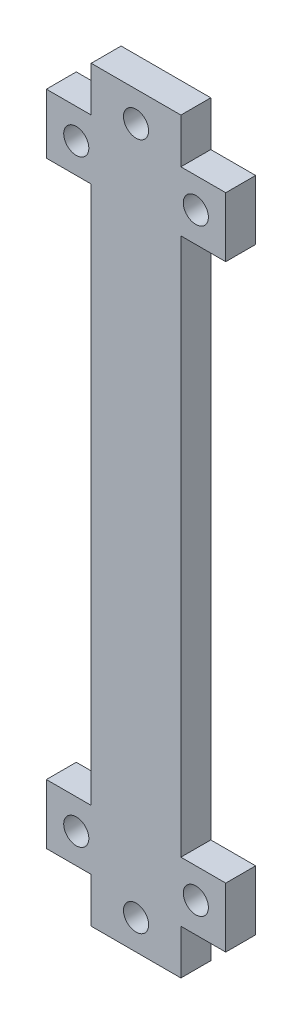
ISO-10303-21;
HEADER;
FILE_DESCRIPTION(('STEP AP214'),'2;1');
FILE_NAME('part.step','',(''),(''),'','','');
FILE_SCHEMA(('AUTOMOTIVE_DESIGN { 1 0 10303 214 1 1 1 1 }'));
ENDSEC;
DATA;
#1=APPLICATION_CONTEXT('core data for automotive mechanical design processes');
#2=APPLICATION_PROTOCOL_DEFINITION('international standard','automotive_design',2000,#1);
#3=PRODUCT_CONTEXT('',#1,'mechanical');
#4=PRODUCT('Part','Part','',(#3));
#5=PRODUCT_RELATED_PRODUCT_CATEGORY('part','',(#4));
#6=PRODUCT_DEFINITION_FORMATION('','',#4);
#7=PRODUCT_DEFINITION_CONTEXT('part definition',#1,'design');
#8=PRODUCT_DEFINITION('design','',#6,#7);
#9=PRODUCT_DEFINITION_SHAPE('','',#8);
#10=(LENGTH_UNIT() NAMED_UNIT(*) SI_UNIT(.MILLI.,.METRE.));
#11=(NAMED_UNIT(*) PLANE_ANGLE_UNIT() SI_UNIT($,.RADIAN.));
#12=(NAMED_UNIT(*) SI_UNIT($,.STERADIAN.) SOLID_ANGLE_UNIT());
#13=UNCERTAINTY_MEASURE_WITH_UNIT(LENGTH_MEASURE(1.E-05),#10,'distance_accuracy_value','');
#14=(GEOMETRIC_REPRESENTATION_CONTEXT(3) GLOBAL_UNCERTAINTY_ASSIGNED_CONTEXT((#13)) GLOBAL_UNIT_ASSIGNED_CONTEXT((#10,
#11,#12)) REPRESENTATION_CONTEXT('',''));
#15=CARTESIAN_POINT('',(0.,0.,0.));
#16=DIRECTION('',(0.,0.,1.));
#17=DIRECTION('',(1.,0.,0.));
#18=AXIS2_PLACEMENT_3D('',#15,#16,#17);
#19=CARTESIAN_POINT('',(0.,0.,5.));
#20=DIRECTION('',(-1.,0.,0.));
#21=DIRECTION('',(0.,0.,1.));
#22=AXIS2_PLACEMENT_3D('',#19,#20,#21);
#23=PLANE('',#22);
#24=DIRECTION('',(0.,1.,0.));
#25=VECTOR('',#24,1.);
#26=CARTESIAN_POINT('',(0.,0.,0.));
#27=LINE('',#26,#25);
#28=CARTESIAN_POINT('',(0.,0.,0.));
#29=VERTEX_POINT('',#28);
#30=CARTESIAN_POINT('',(0.,90.,0.));
#31=VERTEX_POINT('',#30);
#32=EDGE_CURVE('E224',#29,#31,#27,.T.);
#33=ORIENTED_EDGE('',*,*,#32,.F.);
#34=DIRECTION('',(0.,0.,-1.));
#35=VECTOR('',#34,1.);
#36=CARTESIAN_POINT('',(0.,0.,5.));
#37=LINE('',#36,#35);
#38=CARTESIAN_POINT('',(0.,0.,5.));
#39=VERTEX_POINT('',#38);
#40=EDGE_CURVE('E11',#39,#29,#37,.T.);
#41=ORIENTED_EDGE('',*,*,#40,.F.);
#42=DIRECTION('',(0.,1.,0.));
#43=VECTOR('',#42,1.);
#44=CARTESIAN_POINT('',(0.,0.,5.));
#45=LINE('',#44,#43);
#46=CARTESIAN_POINT('',(0.,90.,5.));
#47=VERTEX_POINT('',#46);
#48=EDGE_CURVE('E287',#39,#47,#45,.T.);
#49=ORIENTED_EDGE('',*,*,#48,.T.);
#50=DIRECTION('',(0.,0.,-1.));
#51=VECTOR('',#50,1.);
#52=CARTESIAN_POINT('',(0.,90.,5.));
#53=LINE('',#52,#51);
#54=EDGE_CURVE('E123',#47,#31,#53,.T.);
#55=ORIENTED_EDGE('',*,*,#54,.T.);
#56=EDGE_LOOP('',(#33,#41,#49,#55));
#57=FACE_BOUND('',#56,.T.);
#58=ADVANCED_FACE('F37',(#57),#23,.T.);
#59=CARTESIAN_POINT('',(0.,0.,5.));
#60=DIRECTION('',(0.,1.,0.));
#61=DIRECTION('',(0.,0.,1.));
#62=AXIS2_PLACEMENT_3D('',#59,#60,#61);
#63=PLANE('',#62);
#64=DIRECTION('',(1.,0.,0.));
#65=VECTOR('',#64,1.);
#66=CARTESIAN_POINT('',(0.,0.,0.));
#67=LINE('',#66,#65);
#68=CARTESIAN_POINT('',(-7.5,0.,0.));
#69=VERTEX_POINT('',#68);
#70=EDGE_CURVE('E227',#69,#29,#67,.T.);
#71=ORIENTED_EDGE('',*,*,#70,.F.);
#72=DIRECTION('',(0.,0.,-1.));
#73=VECTOR('',#72,1.);
#74=CARTESIAN_POINT('',(-7.5,0.,5.));
#75=LINE('',#74,#73);
#76=CARTESIAN_POINT('',(-7.5,0.,5.));
#77=VERTEX_POINT('',#76);
#78=EDGE_CURVE('E45',#77,#69,#75,.T.);
#79=ORIENTED_EDGE('',*,*,#78,.F.);
#80=DIRECTION('',(1.,0.,0.));
#81=VECTOR('',#80,1.);
#82=CARTESIAN_POINT('',(0.,0.,5.));
#83=LINE('',#82,#81);
#84=EDGE_CURVE('E339',#77,#39,#83,.T.);
#85=ORIENTED_EDGE('',*,*,#84,.T.);
#86=ORIENTED_EDGE('',*,*,#40,.T.);
#87=EDGE_LOOP('',(#71,#79,#85,#86));
#88=FACE_BOUND('',#87,.T.);
#89=ADVANCED_FACE('F338',(#88),#63,.T.);
#90=CARTESIAN_POINT('',(-7.5,0.,5.));
#91=DIRECTION('',(1.,0.,0.));
#92=DIRECTION('',(0.,0.,-1.));
#93=AXIS2_PLACEMENT_3D('',#90,#91,#92);
#94=PLANE('',#93);
#95=DIRECTION('',(0.,-1.,0.));
#96=VECTOR('',#95,1.);
#97=CARTESIAN_POINT('',(-7.5,0.,0.));
#98=LINE('',#97,#96);
#99=CARTESIAN_POINT('',(-7.5,-10.,0.));
#100=VERTEX_POINT('',#99);
#101=EDGE_CURVE('E230',#69,#100,#98,.T.);
#102=ORIENTED_EDGE('',*,*,#101,.T.);
#103=DIRECTION('',(0.,0.,-1.));
#104=VECTOR('',#103,1.);
#105=CARTESIAN_POINT('',(-7.5,-10.,5.));
#106=LINE('',#105,#104);
#107=CARTESIAN_POINT('',(-7.5,-10.,5.));
#108=VERTEX_POINT('',#107);
#109=EDGE_CURVE('E321',#108,#100,#106,.T.);
#110=ORIENTED_EDGE('',*,*,#109,.F.);
#111=DIRECTION('',(0.,-1.,0.));
#112=VECTOR('',#111,1.);
#113=CARTESIAN_POINT('',(-7.5,0.,5.));
#114=LINE('',#113,#112);
#115=EDGE_CURVE('E328',#77,#108,#114,.T.);
#116=ORIENTED_EDGE('',*,*,#115,.F.);
#117=ORIENTED_EDGE('',*,*,#78,.T.);
#118=EDGE_LOOP('',(#102,#110,#116,#117));
#119=FACE_BOUND('',#118,.T.);
#120=ADVANCED_FACE('F326',(#119),#94,.F.);
#121=CARTESIAN_POINT('',(0.,-10.,5.));
#122=DIRECTION('',(0.,1.,0.));
#123=DIRECTION('',(0.,0.,1.));
#124=AXIS2_PLACEMENT_3D('',#121,#122,#123);
#125=PLANE('',#124);
#126=DIRECTION('',(1.,0.,0.));
#127=VECTOR('',#126,1.);
#128=CARTESIAN_POINT('',(0.,-10.,0.));
#129=LINE('',#128,#127);
#130=CARTESIAN_POINT('',(0.,-10.,0.));
#131=VERTEX_POINT('',#130);
#132=EDGE_CURVE('E233',#100,#131,#129,.T.);
#133=ORIENTED_EDGE('',*,*,#132,.T.);
#134=DIRECTION('',(0.,0.,-1.));
#135=VECTOR('',#134,1.);
#136=CARTESIAN_POINT('',(0.,-10.,5.));
#137=LINE('',#136,#135);
#138=CARTESIAN_POINT('',(0.,-10.,5.));
#139=VERTEX_POINT('',#138);
#140=EDGE_CURVE('E318',#139,#131,#137,.T.);
#141=ORIENTED_EDGE('',*,*,#140,.F.);
#142=DIRECTION('',(1.,0.,0.));
#143=VECTOR('',#142,1.);
#144=CARTESIAN_POINT('',(0.,-10.,5.));
#145=LINE('',#144,#143);
#146=EDGE_CURVE('E346',#108,#139,#145,.T.);
#147=ORIENTED_EDGE('',*,*,#146,.F.);
#148=ORIENTED_EDGE('',*,*,#109,.T.);
#149=EDGE_LOOP('',(#133,#141,#147,#148));
#150=FACE_BOUND('',#149,.T.);
#151=ADVANCED_FACE('F428',(#150),#125,.F.);
#152=CARTESIAN_POINT('',(0.,0.,5.));
#153=DIRECTION('',(1.,0.,0.));
#154=DIRECTION('',(0.,1.,0.));
#155=AXIS2_PLACEMENT_3D('',#152,#153,#154);
#156=PLANE('',#155);
#157=DIRECTION('',(0.,-1.,0.));
#158=VECTOR('',#157,1.);
#159=CARTESIAN_POINT('',(0.,0.,0.));
#160=LINE('',#159,#158);
#161=CARTESIAN_POINT('',(0.,-17.5,0.));
#162=VERTEX_POINT('',#161);
#163=EDGE_CURVE('E235',#131,#162,#160,.T.);
#164=ORIENTED_EDGE('',*,*,#163,.T.);
#165=DIRECTION('',(0.,0.,-1.));
#166=VECTOR('',#165,1.);
#167=CARTESIAN_POINT('',(0.,-17.5,5.));
#168=LINE('',#167,#166);
#169=CARTESIAN_POINT('',(0.,-17.5,5.));
#170=VERTEX_POINT('',#169);
#171=EDGE_CURVE('E315',#170,#162,#168,.T.);
#172=ORIENTED_EDGE('',*,*,#171,.F.);
#173=DIRECTION('',(0.,-1.,0.));
#174=VECTOR('',#173,1.);
#175=CARTESIAN_POINT('',(0.,0.,5.));
#176=LINE('',#175,#174);
#177=EDGE_CURVE('E348',#139,#170,#176,.T.);
#178=ORIENTED_EDGE('',*,*,#177,.F.);
#179=ORIENTED_EDGE('',*,*,#140,.T.);
#180=EDGE_LOOP('',(#164,#172,#178,#179));
#181=FACE_BOUND('',#180,.T.);
#182=ADVANCED_FACE('F423',(#181),#156,.F.);
#183=CARTESIAN_POINT('',(0.,-17.5,5.));
#184=DIRECTION('',(0.,1.,0.));
#185=DIRECTION('',(-1.,0.,0.));
#186=AXIS2_PLACEMENT_3D('',#183,#184,#185);
#187=PLANE('',#186);
#188=DIRECTION('',(1.,0.,0.));
#189=VECTOR('',#188,1.);
#190=CARTESIAN_POINT('',(0.,-17.5,0.));
#191=LINE('',#190,#189);
#192=CARTESIAN_POINT('',(15.,-17.5,0.));
#193=VERTEX_POINT('',#192);
#194=EDGE_CURVE('E238',#162,#193,#191,.T.);
#195=ORIENTED_EDGE('',*,*,#194,.T.);
#196=DIRECTION('',(0.,0.,-1.));
#197=VECTOR('',#196,1.);
#198=CARTESIAN_POINT('',(15.,-17.5,5.));
#199=LINE('',#198,#197);
#200=CARTESIAN_POINT('',(15.,-17.5,5.));
#201=VERTEX_POINT('',#200);
#202=EDGE_CURVE('E313',#201,#193,#199,.T.);
#203=ORIENTED_EDGE('',*,*,#202,.F.);
#204=DIRECTION('',(1.,0.,0.));
#205=VECTOR('',#204,1.);
#206=CARTESIAN_POINT('',(0.,-17.5,5.));
#207=LINE('',#206,#205);
#208=EDGE_CURVE('E351',#170,#201,#207,.T.);
#209=ORIENTED_EDGE('',*,*,#208,.F.);
#210=ORIENTED_EDGE('',*,*,#171,.T.);
#211=EDGE_LOOP('',(#195,#203,#209,#210));
#212=FACE_BOUND('',#211,.T.);
#213=ADVANCED_FACE('F420',(#212),#187,.F.);
#214=CARTESIAN_POINT('',(15.,0.,5.));
#215=DIRECTION('',(1.,0.,0.));
#216=DIRECTION('',(0.,0.,-1.));
#217=AXIS2_PLACEMENT_3D('',#214,#215,#216);
#218=PLANE('',#217);
#219=DIRECTION('',(0.,-1.,0.));
#220=VECTOR('',#219,1.);
#221=CARTESIAN_POINT('',(15.,0.,0.));
#222=LINE('',#221,#220);
#223=CARTESIAN_POINT('',(15.,-10.,0.));
#224=VERTEX_POINT('',#223);
#225=EDGE_CURVE('E241',#224,#193,#222,.T.);
#226=ORIENTED_EDGE('',*,*,#225,.F.);
#227=DIRECTION('',(0.,0.,-1.));
#228=VECTOR('',#227,1.);
#229=CARTESIAN_POINT('',(15.,-10.,5.));
#230=LINE('',#229,#228);
#231=CARTESIAN_POINT('',(15.,-10.,5.));
#232=VERTEX_POINT('',#231);
#233=EDGE_CURVE('E311',#232,#224,#230,.T.);
#234=ORIENTED_EDGE('',*,*,#233,.F.);
#235=DIRECTION('',(0.,-1.,0.));
#236=VECTOR('',#235,1.);
#237=CARTESIAN_POINT('',(15.,0.,5.));
#238=LINE('',#237,#236);
#239=EDGE_CURVE('E353',#232,#201,#238,.T.);
#240=ORIENTED_EDGE('',*,*,#239,.T.);
#241=ORIENTED_EDGE('',*,*,#202,.T.);
#242=EDGE_LOOP('',(#226,#234,#240,#241));
#243=FACE_BOUND('',#242,.T.);
#244=ADVANCED_FACE('F414',(#243),#218,.T.);
#245=CARTESIAN_POINT('',(22.5,-10.,0.));
#246=VERTEX_POINT('',#245);
#247=EDGE_CURVE('E236',#224,#246,#129,.T.);
#248=ORIENTED_EDGE('',*,*,#247,.T.);
#249=DIRECTION('',(0.,0.,-1.));
#250=VECTOR('',#249,1.);
#251=CARTESIAN_POINT('',(22.5,-10.,5.));
#252=LINE('',#251,#250);
#253=CARTESIAN_POINT('',(22.5,-10.,5.));
#254=VERTEX_POINT('',#253);
#255=EDGE_CURVE('E309',#254,#246,#252,.T.);
#256=ORIENTED_EDGE('',*,*,#255,.F.);
#257=EDGE_CURVE('E349',#232,#254,#145,.T.);
#258=ORIENTED_EDGE('',*,*,#257,.F.);
#259=ORIENTED_EDGE('',*,*,#233,.T.);
#260=EDGE_LOOP('',(#248,#256,#258,#259));
#261=FACE_BOUND('',#260,.T.);
#262=ADVANCED_FACE('F429',(#261),#125,.F.);
#263=CARTESIAN_POINT('',(22.5,0.,5.));
#264=DIRECTION('',(1.,0.,0.));
#265=DIRECTION('',(0.,0.,-1.));
#266=AXIS2_PLACEMENT_3D('',#263,#264,#265);
#267=PLANE('',#266);
#268=DIRECTION('',(0.,-1.,0.));
#269=VECTOR('',#268,1.);
#270=CARTESIAN_POINT('',(22.5,0.,0.));
#271=LINE('',#270,#269);
#272=CARTESIAN_POINT('',(22.5,0.,0.));
#273=VERTEX_POINT('',#272);
#274=EDGE_CURVE('E244',#273,#246,#271,.T.);
#275=ORIENTED_EDGE('',*,*,#274,.F.);
#276=DIRECTION('',(0.,0.,-1.));
#277=VECTOR('',#276,1.);
#278=CARTESIAN_POINT('',(22.5,0.,5.));
#279=LINE('',#278,#277);
#280=CARTESIAN_POINT('',(22.5,0.,5.));
#281=VERTEX_POINT('',#280);
#282=EDGE_CURVE('E307',#281,#273,#279,.T.);
#283=ORIENTED_EDGE('',*,*,#282,.F.);
#284=DIRECTION('',(0.,-1.,0.));
#285=VECTOR('',#284,1.);
#286=CARTESIAN_POINT('',(22.5,0.,5.));
#287=LINE('',#286,#285);
#288=EDGE_CURVE('E356',#281,#254,#287,.T.);
#289=ORIENTED_EDGE('',*,*,#288,.T.);
#290=ORIENTED_EDGE('',*,*,#255,.T.);
#291=EDGE_LOOP('',(#275,#283,#289,#290));
#292=FACE_BOUND('',#291,.T.);
#293=ADVANCED_FACE('F406',(#292),#267,.T.);
#294=CARTESIAN_POINT('',(15.,0.,0.));
#295=VERTEX_POINT('',#294);
#296=EDGE_CURVE('E231',#295,#273,#67,.T.);
#297=ORIENTED_EDGE('',*,*,#296,.F.);
#298=DIRECTION('',(0.,0.,-1.));
#299=VECTOR('',#298,1.);
#300=CARTESIAN_POINT('',(15.,0.,5.));
#301=LINE('',#300,#299);
#302=CARTESIAN_POINT('',(15.,0.,5.));
#303=VERTEX_POINT('',#302);
#304=EDGE_CURVE('E305',#303,#295,#301,.T.);
#305=ORIENTED_EDGE('',*,*,#304,.F.);
#306=EDGE_CURVE('E343',#303,#281,#83,.T.);
#307=ORIENTED_EDGE('',*,*,#306,.T.);
#308=ORIENTED_EDGE('',*,*,#282,.T.);
#309=EDGE_LOOP('',(#297,#305,#307,#308));
#310=FACE_BOUND('',#309,.T.);
#311=ADVANCED_FACE('F401',(#310),#63,.T.);
#312=CARTESIAN_POINT('',(15.,0.,5.));
#313=DIRECTION('',(-1.,0.,0.));
#314=DIRECTION('',(0.,0.,1.));
#315=AXIS2_PLACEMENT_3D('',#312,#313,#314);
#316=PLANE('',#315);
#317=DIRECTION('',(0.,1.,0.));
#318=VECTOR('',#317,1.);
#319=CARTESIAN_POINT('',(15.,0.,0.));
#320=LINE('',#319,#318);
#321=CARTESIAN_POINT('',(15.,90.,0.));
#322=VERTEX_POINT('',#321);
#323=EDGE_CURVE('E247',#295,#322,#320,.T.);
#324=ORIENTED_EDGE('',*,*,#323,.T.);
#325=DIRECTION('',(0.,0.,-1.));
#326=VECTOR('',#325,1.);
#327=CARTESIAN_POINT('',(15.,90.,5.));
#328=LINE('',#327,#326);
#329=CARTESIAN_POINT('',(15.,90.,5.));
#330=VERTEX_POINT('',#329);
#331=EDGE_CURVE('E302',#330,#322,#328,.T.);
#332=ORIENTED_EDGE('',*,*,#331,.F.);
#333=DIRECTION('',(0.,1.,0.));
#334=VECTOR('',#333,1.);
#335=CARTESIAN_POINT('',(15.,0.,5.));
#336=LINE('',#335,#334);
#337=EDGE_CURVE('E359',#303,#330,#336,.T.);
#338=ORIENTED_EDGE('',*,*,#337,.F.);
#339=ORIENTED_EDGE('',*,*,#304,.T.);
#340=EDGE_LOOP('',(#324,#332,#338,#339));
#341=FACE_BOUND('',#340,.T.);
#342=ADVANCED_FACE('F396',(#341),#316,.F.);
#343=CARTESIAN_POINT('',(0.,90.,5.));
#344=DIRECTION('',(0.,1.,0.));
#345=DIRECTION('',(0.,0.,1.));
#346=AXIS2_PLACEMENT_3D('',#343,#344,#345);
#347=PLANE('',#346);
#348=DIRECTION('',(1.,0.,0.));
#349=VECTOR('',#348,1.);
#350=CARTESIAN_POINT('',(0.,90.,0.));
#351=LINE('',#350,#349);
#352=CARTESIAN_POINT('',(22.5,90.,0.));
#353=VERTEX_POINT('',#352);
#354=EDGE_CURVE('E249',#322,#353,#351,.T.);
#355=ORIENTED_EDGE('',*,*,#354,.T.);
#356=DIRECTION('',(0.,0.,-1.));
#357=VECTOR('',#356,1.);
#358=CARTESIAN_POINT('',(22.5,90.,5.));
#359=LINE('',#358,#357);
#360=CARTESIAN_POINT('',(22.5,90.,5.));
#361=VERTEX_POINT('',#360);
#362=EDGE_CURVE('E299',#361,#353,#359,.T.);
#363=ORIENTED_EDGE('',*,*,#362,.F.);
#364=DIRECTION('',(1.,0.,0.));
#365=VECTOR('',#364,1.);
#366=CARTESIAN_POINT('',(0.,90.,5.));
#367=LINE('',#366,#365);
#368=EDGE_CURVE('E203',#330,#361,#367,.T.);
#369=ORIENTED_EDGE('',*,*,#368,.F.);
#370=ORIENTED_EDGE('',*,*,#331,.T.);
#371=EDGE_LOOP('',(#355,#363,#369,#370));
#372=FACE_BOUND('',#371,.T.);
#373=ADVANCED_FACE('F392',(#372),#347,.F.);
#374=CARTESIAN_POINT('',(22.5,0.,5.));
#375=DIRECTION('',(-1.,0.,0.));
#376=DIRECTION('',(0.,0.,1.));
#377=AXIS2_PLACEMENT_3D('',#374,#375,#376);
#378=PLANE('',#377);
#379=DIRECTION('',(0.,1.,0.));
#380=VECTOR('',#379,1.);
#381=CARTESIAN_POINT('',(22.5,0.,0.));
#382=LINE('',#381,#380);
#383=CARTESIAN_POINT('',(22.5,100.,0.));
#384=VERTEX_POINT('',#383);
#385=EDGE_CURVE('E251',#353,#384,#382,.T.);
#386=ORIENTED_EDGE('',*,*,#385,.T.);
#387=DIRECTION('',(0.,0.,-1.));
#388=VECTOR('',#387,1.);
#389=CARTESIAN_POINT('',(22.5,100.,5.));
#390=LINE('',#389,#388);
#391=CARTESIAN_POINT('',(22.5,100.,5.));
#392=VERTEX_POINT('',#391);
#393=EDGE_CURVE('E297',#392,#384,#390,.T.);
#394=ORIENTED_EDGE('',*,*,#393,.F.);
#395=DIRECTION('',(0.,1.,0.));
#396=VECTOR('',#395,1.);
#397=CARTESIAN_POINT('',(22.5,0.,5.));
#398=LINE('',#397,#396);
#399=EDGE_CURVE('E361',#361,#392,#398,.T.);
#400=ORIENTED_EDGE('',*,*,#399,.F.);
#401=ORIENTED_EDGE('',*,*,#362,.T.);
#402=EDGE_LOOP('',(#386,#394,#400,#401));
#403=FACE_BOUND('',#402,.T.);
#404=ADVANCED_FACE('F387',(#403),#378,.F.);
#405=CARTESIAN_POINT('',(0.,100.,5.));
#406=DIRECTION('',(0.,1.,0.));
#407=DIRECTION('',(0.,0.,1.));
#408=AXIS2_PLACEMENT_3D('',#405,#406,#407);
#409=PLANE('',#408);
#410=DIRECTION('',(1.,0.,0.));
#411=VECTOR('',#410,1.);
#412=CARTESIAN_POINT('',(0.,100.,0.));
#413=LINE('',#412,#411);
#414=CARTESIAN_POINT('',(15.,100.,0.));
#415=VERTEX_POINT('',#414);
#416=EDGE_CURVE('E255',#415,#384,#413,.T.);
#417=ORIENTED_EDGE('',*,*,#416,.F.);
#418=DIRECTION('',(0.,0.,-1.));
#419=VECTOR('',#418,1.);
#420=CARTESIAN_POINT('',(15.,100.,5.));
#421=LINE('',#420,#419);
#422=CARTESIAN_POINT('',(15.,100.,5.));
#423=VERTEX_POINT('',#422);
#424=EDGE_CURVE('E295',#423,#415,#421,.T.);
#425=ORIENTED_EDGE('',*,*,#424,.F.);
#426=DIRECTION('',(1.,0.,0.));
#427=VECTOR('',#426,1.);
#428=CARTESIAN_POINT('',(0.,100.,5.));
#429=LINE('',#428,#427);
#430=EDGE_CURVE('E198',#423,#392,#429,.T.);
#431=ORIENTED_EDGE('',*,*,#430,.T.);
#432=ORIENTED_EDGE('',*,*,#393,.T.);
#433=EDGE_LOOP('',(#417,#425,#431,#432));
#434=FACE_BOUND('',#433,.T.);
#435=ADVANCED_FACE('F381',(#434),#409,.T.);
#436=CARTESIAN_POINT('',(15.,0.,5.));
#437=DIRECTION('',(-1.,0.,0.));
#438=DIRECTION('',(0.,0.,1.));
#439=AXIS2_PLACEMENT_3D('',#436,#437,#438);
#440=PLANE('',#439);
#441=DIRECTION('',(0.,1.,0.));
#442=VECTOR('',#441,1.);
#443=CARTESIAN_POINT('',(15.,0.,0.));
#444=LINE('',#443,#442);
#445=CARTESIAN_POINT('',(15.,107.5,0.));
#446=VERTEX_POINT('',#445);
#447=EDGE_CURVE('E258',#415,#446,#444,.T.);
#448=ORIENTED_EDGE('',*,*,#447,.T.);
#449=DIRECTION('',(0.,0.,-1.));
#450=VECTOR('',#449,1.);
#451=CARTESIAN_POINT('',(15.,107.5,5.));
#452=LINE('',#451,#450);
#453=CARTESIAN_POINT('',(15.,107.5,5.));
#454=VERTEX_POINT('',#453);
#455=EDGE_CURVE('E293',#454,#446,#452,.T.);
#456=ORIENTED_EDGE('',*,*,#455,.F.);
#457=DIRECTION('',(0.,1.,0.));
#458=VECTOR('',#457,1.);
#459=CARTESIAN_POINT('',(15.,0.,5.));
#460=LINE('',#459,#458);
#461=EDGE_CURVE('E364',#423,#454,#460,.T.);
#462=ORIENTED_EDGE('',*,*,#461,.F.);
#463=ORIENTED_EDGE('',*,*,#424,.T.);
#464=EDGE_LOOP('',(#448,#456,#462,#463));
#465=FACE_BOUND('',#464,.T.);
#466=ADVANCED_FACE('F378',(#465),#440,.F.);
#467=CARTESIAN_POINT('',(0.,107.5,5.));
#468=DIRECTION('',(0.,1.,0.));
#469=DIRECTION('',(0.,0.,1.));
#470=AXIS2_PLACEMENT_3D('',#467,#468,#469);
#471=PLANE('',#470);
#472=DIRECTION('',(1.,0.,0.));
#473=VECTOR('',#472,1.);
#474=CARTESIAN_POINT('',(0.,107.5,0.));
#475=LINE('',#474,#473);
#476=CARTESIAN_POINT('',(0.,107.5,0.));
#477=VERTEX_POINT('',#476);
#478=EDGE_CURVE('E261',#477,#446,#475,.T.);
#479=ORIENTED_EDGE('',*,*,#478,.F.);
#480=DIRECTION('',(0.,0.,-1.));
#481=VECTOR('',#480,1.);
#482=CARTESIAN_POINT('',(0.,107.5,5.));
#483=LINE('',#482,#481);
#484=CARTESIAN_POINT('',(0.,107.5,5.));
#485=VERTEX_POINT('',#484);
#486=EDGE_CURVE('E291',#485,#477,#483,.T.);
#487=ORIENTED_EDGE('',*,*,#486,.F.);
#488=DIRECTION('',(1.,0.,0.));
#489=VECTOR('',#488,1.);
#490=CARTESIAN_POINT('',(0.,107.5,5.));
#491=LINE('',#490,#489);
#492=EDGE_CURVE('E365',#485,#454,#491,.T.);
#493=ORIENTED_EDGE('',*,*,#492,.T.);
#494=ORIENTED_EDGE('',*,*,#455,.T.);
#495=EDGE_LOOP('',(#479,#487,#493,#494));
#496=FACE_BOUND('',#495,.T.);
#497=ADVANCED_FACE('F374',(#496),#471,.T.);
#498=CARTESIAN_POINT('',(0.,0.,5.));
#499=DIRECTION('',(-1.,0.,0.));
#500=DIRECTION('',(0.,-1.,0.));
#501=AXIS2_PLACEMENT_3D('',#498,#499,#500);
#502=PLANE('',#501);
#503=DIRECTION('',(0.,1.,0.));
#504=VECTOR('',#503,1.);
#505=CARTESIAN_POINT('',(0.,0.,0.));
#506=LINE('',#505,#504);
#507=CARTESIAN_POINT('',(0.,100.,0.));
#508=VERTEX_POINT('',#507);
#509=EDGE_CURVE('E264',#508,#477,#506,.T.);
#510=ORIENTED_EDGE('',*,*,#509,.F.);
#511=DIRECTION('',(0.,0.,-1.));
#512=VECTOR('',#511,1.);
#513=CARTESIAN_POINT('',(0.,100.,5.));
#514=LINE('',#513,#512);
#515=CARTESIAN_POINT('',(0.,100.,5.));
#516=VERTEX_POINT('',#515);
#517=EDGE_CURVE('E188',#516,#508,#514,.T.);
#518=ORIENTED_EDGE('',*,*,#517,.F.);
#519=DIRECTION('',(0.,1.,0.));
#520=VECTOR('',#519,1.);
#521=CARTESIAN_POINT('',(0.,0.,5.));
#522=LINE('',#521,#520);
#523=EDGE_CURVE('E196',#516,#485,#522,.T.);
#524=ORIENTED_EDGE('',*,*,#523,.T.);
#525=ORIENTED_EDGE('',*,*,#486,.T.);
#526=EDGE_LOOP('',(#510,#518,#524,#525));
#527=FACE_BOUND('',#526,.T.);
#528=ADVANCED_FACE('F370',(#527),#502,.T.);
#529=CARTESIAN_POINT('',(-7.5,100.,0.));
#530=VERTEX_POINT('',#529);
#531=EDGE_CURVE('E183',#530,#508,#413,.T.);
#532=ORIENTED_EDGE('',*,*,#531,.F.);
#533=DIRECTION('',(0.,0.,-1.));
#534=VECTOR('',#533,1.);
#535=CARTESIAN_POINT('',(-7.5,100.,5.));
#536=LINE('',#535,#534);
#537=CARTESIAN_POINT('',(-7.5,100.,5.));
#538=VERTEX_POINT('',#537);
#539=EDGE_CURVE('E178',#538,#530,#536,.T.);
#540=ORIENTED_EDGE('',*,*,#539,.F.);
#541=EDGE_CURVE('E181',#538,#516,#429,.T.);
#542=ORIENTED_EDGE('',*,*,#541,.T.);
#543=ORIENTED_EDGE('',*,*,#517,.T.);
#544=EDGE_LOOP('',(#532,#540,#542,#543));
#545=FACE_BOUND('',#544,.T.);
#546=ADVANCED_FACE('F180',(#545),#409,.T.);
#547=CARTESIAN_POINT('',(-7.5,0.,5.));
#548=DIRECTION('',(-1.,0.,0.));
#549=DIRECTION('',(0.,0.,1.));
#550=AXIS2_PLACEMENT_3D('',#547,#548,#549);
#551=PLANE('',#550);
#552=DIRECTION('',(0.,1.,0.));
#553=VECTOR('',#552,1.);
#554=CARTESIAN_POINT('',(-7.5,0.,0.));
#555=LINE('',#554,#553);
#556=CARTESIAN_POINT('',(-7.5,90.,0.));
#557=VERTEX_POINT('',#556);
#558=EDGE_CURVE('E267',#557,#530,#555,.T.);
#559=ORIENTED_EDGE('',*,*,#558,.F.);
#560=DIRECTION('',(0.,0.,-1.));
#561=VECTOR('',#560,1.);
#562=CARTESIAN_POINT('',(-7.5,90.,5.));
#563=LINE('',#562,#561);
#564=CARTESIAN_POINT('',(-7.5,90.,5.));
#565=VERTEX_POINT('',#564);
#566=EDGE_CURVE('E116',#565,#557,#563,.T.);
#567=ORIENTED_EDGE('',*,*,#566,.F.);
#568=DIRECTION('',(0.,1.,0.));
#569=VECTOR('',#568,1.);
#570=CARTESIAN_POINT('',(-7.5,0.,5.));
#571=LINE('',#570,#569);
#572=EDGE_CURVE('E193',#565,#538,#571,.T.);
#573=ORIENTED_EDGE('',*,*,#572,.T.);
#574=ORIENTED_EDGE('',*,*,#539,.T.);
#575=EDGE_LOOP('',(#559,#567,#573,#574));
#576=FACE_BOUND('',#575,.T.);
#577=ADVANCED_FACE('F199',(#576),#551,.T.);
#578=CARTESIAN_POINT('',(7.5,102.5,5.));
#579=DIRECTION('',(0.,0.,-1.));
#580=DIRECTION('',(-1.,0.,0.));
#581=AXIS2_PLACEMENT_3D('',#578,#579,#580);
#582=CYLINDRICAL_SURFACE('',#581,2.1);
#583=CARTESIAN_POINT('',(7.5,102.5,5.));
#584=DIRECTION('',(0.,0.,1.));
#585=DIRECTION('',(1.,0.,0.));
#586=AXIS2_PLACEMENT_3D('',#583,#584,#585);
#587=CIRCLE('',#586,2.1);
#588=CARTESIAN_POINT('',(9.6,102.5,5.));
#589=VERTEX_POINT('',#588);
#590=EDGE_CURVE('E218',#589,#589,#587,.T.);
#591=ORIENTED_EDGE('',*,*,#590,.T.);
#592=EDGE_LOOP('',(#591));
#593=FACE_BOUND('',#592,.T.);
#594=CARTESIAN_POINT('',(7.5,102.5,0.));
#595=DIRECTION('',(0.,0.,1.));
#596=DIRECTION('',(1.,0.,0.));
#597=AXIS2_PLACEMENT_3D('',#594,#595,#596);
#598=CIRCLE('',#597,2.1);
#599=CARTESIAN_POINT('',(9.6,102.5,0.));
#600=VERTEX_POINT('',#599);
#601=EDGE_CURVE('E281',#600,#600,#598,.T.);
#602=ORIENTED_EDGE('',*,*,#601,.F.);
#603=EDGE_LOOP('',(#602));
#604=FACE_BOUND('',#603,.T.);
#605=ADVANCED_FACE('F468',(#593,#604),#582,.F.);
#606=CARTESIAN_POINT('',(-2.5,-5.00000000000003,5.));
#607=DIRECTION('',(0.,0.,-1.));
#608=DIRECTION('',(-1.,0.,0.));
#609=AXIS2_PLACEMENT_3D('',#606,#607,#608);
#610=CYLINDRICAL_SURFACE('',#609,2.1);
#611=CARTESIAN_POINT('',(-2.5,-5.00000000000003,5.));
#612=DIRECTION('',(0.,0.,1.));
#613=DIRECTION('',(1.,0.,0.));
#614=AXIS2_PLACEMENT_3D('',#611,#612,#613);
#615=CIRCLE('',#614,2.1);
#616=CARTESIAN_POINT('',(-0.399999999999995,-5.00000000000003,5.));
#617=VERTEX_POINT('',#616);
#618=EDGE_CURVE('E215',#617,#617,#615,.F.);
#619=ORIENTED_EDGE('',*,*,#618,.F.);
#620=EDGE_LOOP('',(#619));
#621=FACE_BOUND('',#620,.T.);
#622=CARTESIAN_POINT('',(-2.5,-5.00000000000003,0.));
#623=DIRECTION('',(0.,0.,1.));
#624=DIRECTION('',(1.,0.,0.));
#625=AXIS2_PLACEMENT_3D('',#622,#623,#624);
#626=CIRCLE('',#625,2.1);
#627=CARTESIAN_POINT('',(-0.399999999999995,-5.00000000000003,0.));
#628=VERTEX_POINT('',#627);
#629=EDGE_CURVE('E278',#628,#628,#626,.F.);
#630=ORIENTED_EDGE('',*,*,#629,.T.);
#631=EDGE_LOOP('',(#630));
#632=FACE_BOUND('',#631,.T.);
#633=ADVANCED_FACE('F483',(#621,#632),#610,.F.);
#634=CARTESIAN_POINT('',(17.5,-5.00000000000003,5.));
#635=DIRECTION('',(0.,0.,-1.));
#636=DIRECTION('',(-1.,0.,0.));
#637=AXIS2_PLACEMENT_3D('',#634,#635,#636);
#638=CYLINDRICAL_SURFACE('',#637,2.1);
#639=CARTESIAN_POINT('',(17.5,-5.00000000000003,5.));
#640=DIRECTION('',(0.,0.,1.));
#641=DIRECTION('',(1.,0.,0.));
#642=AXIS2_PLACEMENT_3D('',#639,#640,#641);
#643=CIRCLE('',#642,2.1);
#644=CARTESIAN_POINT('',(19.6,-5.00000000000003,5.));
#645=VERTEX_POINT('',#644);
#646=EDGE_CURVE('E212',#645,#645,#643,.T.);
#647=ORIENTED_EDGE('',*,*,#646,.T.);
#648=EDGE_LOOP('',(#647));
#649=FACE_BOUND('',#648,.T.);
#650=CARTESIAN_POINT('',(17.5,-5.00000000000003,0.));
#651=DIRECTION('',(0.,0.,1.));
#652=DIRECTION('',(1.,0.,0.));
#653=AXIS2_PLACEMENT_3D('',#650,#651,#652);
#654=CIRCLE('',#653,2.1);
#655=CARTESIAN_POINT('',(19.6,-5.00000000000003,0.));
#656=VERTEX_POINT('',#655);
#657=EDGE_CURVE('E275',#656,#656,#654,.T.);
#658=ORIENTED_EDGE('',*,*,#657,.F.);
#659=EDGE_LOOP('',(#658));
#660=FACE_BOUND('',#659,.T.);
#661=ADVANCED_FACE('F479',(#649,#660),#638,.F.);
#662=CARTESIAN_POINT('',(17.5,95.,5.));
#663=DIRECTION('',(0.,0.,-1.));
#664=DIRECTION('',(-1.,0.,0.));
#665=AXIS2_PLACEMENT_3D('',#662,#663,#664);
#666=CYLINDRICAL_SURFACE('',#665,2.1);
#667=CARTESIAN_POINT('',(17.5,95.,5.));
#668=DIRECTION('',(0.,0.,1.));
#669=DIRECTION('',(1.,0.,0.));
#670=AXIS2_PLACEMENT_3D('',#667,#668,#669);
#671=CIRCLE('',#670,2.1);
#672=CARTESIAN_POINT('',(19.6,95.,5.));
#673=VERTEX_POINT('',#672);
#674=EDGE_CURVE('E209',#673,#673,#671,.F.);
#675=ORIENTED_EDGE('',*,*,#674,.F.);
#676=EDGE_LOOP('',(#675));
#677=FACE_BOUND('',#676,.T.);
#678=CARTESIAN_POINT('',(17.5,95.,0.));
#679=DIRECTION('',(0.,0.,1.));
#680=DIRECTION('',(1.,0.,0.));
#681=AXIS2_PLACEMENT_3D('',#678,#679,#680);
#682=CIRCLE('',#681,2.1);
#683=CARTESIAN_POINT('',(19.6,95.,0.));
#684=VERTEX_POINT('',#683);
#685=EDGE_CURVE('E272',#684,#684,#682,.F.);
#686=ORIENTED_EDGE('',*,*,#685,.T.);
#687=EDGE_LOOP('',(#686));
#688=FACE_BOUND('',#687,.T.);
#689=ADVANCED_FACE('F475',(#677,#688),#666,.F.);
#690=CARTESIAN_POINT('',(-2.5,95.,5.));
#691=DIRECTION('',(0.,0.,-1.));
#692=DIRECTION('',(-1.,0.,0.));
#693=AXIS2_PLACEMENT_3D('',#690,#691,#692);
#694=CYLINDRICAL_SURFACE('',#693,2.1);
#695=CARTESIAN_POINT('',(-2.5,95.,5.));
#696=DIRECTION('',(0.,0.,1.));
#697=DIRECTION('',(1.,0.,0.));
#698=AXIS2_PLACEMENT_3D('',#695,#696,#697);
#699=CIRCLE('',#698,2.1);
#700=CARTESIAN_POINT('',(-0.399999999999995,95.,5.));
#701=VERTEX_POINT('',#700);
#702=EDGE_CURVE('E201',#701,#701,#699,.T.);
#703=ORIENTED_EDGE('',*,*,#702,.T.);
#704=EDGE_LOOP('',(#703));
#705=FACE_BOUND('',#704,.T.);
#706=CARTESIAN_POINT('',(-2.5,95.,0.));
#707=DIRECTION('',(0.,0.,1.));
#708=DIRECTION('',(1.,0.,0.));
#709=AXIS2_PLACEMENT_3D('',#706,#707,#708);
#710=CIRCLE('',#709,2.1);
#711=CARTESIAN_POINT('',(-0.399999999999995,95.,0.));
#712=VERTEX_POINT('',#711);
#713=EDGE_CURVE('E269',#712,#712,#710,.T.);
#714=ORIENTED_EDGE('',*,*,#713,.F.);
#715=EDGE_LOOP('',(#714));
#716=FACE_BOUND('',#715,.T.);
#717=ADVANCED_FACE('F472',(#705,#716),#694,.F.);
#718=EDGE_CURVE('E252',#557,#31,#351,.T.);
#719=ORIENTED_EDGE('',*,*,#718,.T.);
#720=ORIENTED_EDGE('',*,*,#54,.F.);
#721=EDGE_CURVE('E53',#565,#47,#367,.T.);
#722=ORIENTED_EDGE('',*,*,#721,.F.);
#723=ORIENTED_EDGE('',*,*,#566,.T.);
#724=EDGE_LOOP('',(#719,#720,#722,#723));
#725=FACE_BOUND('',#724,.T.);
#726=ADVANCED_FACE('F340',(#725),#347,.F.);
#727=CARTESIAN_POINT('',(7.5,-12.5,5.));
#728=DIRECTION('',(0.,0.,-1.));
#729=DIRECTION('',(-1.,0.,0.));
#730=AXIS2_PLACEMENT_3D('',#727,#728,#729);
#731=CYLINDRICAL_SURFACE('',#730,2.1);
#732=CARTESIAN_POINT('',(7.5,-12.5,5.));
#733=DIRECTION('',(0.,0.,1.));
#734=DIRECTION('',(1.,0.,0.));
#735=AXIS2_PLACEMENT_3D('',#732,#733,#734);
#736=CIRCLE('',#735,2.1);
#737=CARTESIAN_POINT('',(9.6,-12.5,5.));
#738=VERTEX_POINT('',#737);
#739=EDGE_CURVE('E221',#738,#738,#736,.F.);
#740=ORIENTED_EDGE('',*,*,#739,.F.);
#741=EDGE_LOOP('',(#740));
#742=FACE_BOUND('',#741,.T.);
#743=CARTESIAN_POINT('',(7.5,-12.5,0.));
#744=DIRECTION('',(0.,0.,1.));
#745=DIRECTION('',(1.,0.,0.));
#746=AXIS2_PLACEMENT_3D('',#743,#744,#745);
#747=CIRCLE('',#746,2.1);
#748=CARTESIAN_POINT('',(9.6,-12.5,0.));
#749=VERTEX_POINT('',#748);
#750=EDGE_CURVE('E284',#749,#749,#747,.F.);
#751=ORIENTED_EDGE('',*,*,#750,.T.);
#752=EDGE_LOOP('',(#751));
#753=FACE_BOUND('',#752,.T.);
#754=ADVANCED_FACE('F471',(#742,#753),#731,.F.);
#755=CARTESIAN_POINT('',(0.,0.,5.));
#756=DIRECTION('',(0.,0.,1.));
#757=DIRECTION('',(1.,0.,0.));
#758=AXIS2_PLACEMENT_3D('',#755,#756,#757);
#759=PLANE('',#758);
#760=ORIENTED_EDGE('',*,*,#48,.F.);
#761=ORIENTED_EDGE('',*,*,#84,.F.);
#762=ORIENTED_EDGE('',*,*,#115,.T.);
#763=ORIENTED_EDGE('',*,*,#146,.T.);
#764=ORIENTED_EDGE('',*,*,#177,.T.);
#765=ORIENTED_EDGE('',*,*,#208,.T.);
#766=ORIENTED_EDGE('',*,*,#239,.F.);
#767=ORIENTED_EDGE('',*,*,#257,.T.);
#768=ORIENTED_EDGE('',*,*,#288,.F.);
#769=ORIENTED_EDGE('',*,*,#306,.F.);
#770=ORIENTED_EDGE('',*,*,#337,.T.);
#771=ORIENTED_EDGE('',*,*,#368,.T.);
#772=ORIENTED_EDGE('',*,*,#399,.T.);
#773=ORIENTED_EDGE('',*,*,#430,.F.);
#774=ORIENTED_EDGE('',*,*,#461,.T.);
#775=ORIENTED_EDGE('',*,*,#492,.F.);
#776=ORIENTED_EDGE('',*,*,#523,.F.);
#777=ORIENTED_EDGE('',*,*,#541,.F.);
#778=ORIENTED_EDGE('',*,*,#572,.F.);
#779=ORIENTED_EDGE('',*,*,#721,.T.);
#780=EDGE_LOOP('',(#760,#761,#762,#763,#764,#765,#766,#767,#768,#769,#770,#771,#772,#773,#774,
#775,#776,#777,#778,#779));
#781=FACE_BOUND('',#780,.T.);
#782=ORIENTED_EDGE('',*,*,#702,.F.);
#783=EDGE_LOOP('',(#782));
#784=FACE_BOUND('',#783,.T.);
#785=ORIENTED_EDGE('',*,*,#674,.T.);
#786=EDGE_LOOP('',(#785));
#787=FACE_BOUND('',#786,.T.);
#788=ORIENTED_EDGE('',*,*,#646,.F.);
#789=EDGE_LOOP('',(#788));
#790=FACE_BOUND('',#789,.T.);
#791=ORIENTED_EDGE('',*,*,#618,.T.);
#792=EDGE_LOOP('',(#791));
#793=FACE_BOUND('',#792,.T.);
#794=ORIENTED_EDGE('',*,*,#590,.F.);
#795=EDGE_LOOP('',(#794));
#796=FACE_BOUND('',#795,.T.);
#797=ORIENTED_EDGE('',*,*,#739,.T.);
#798=EDGE_LOOP('',(#797));
#799=FACE_BOUND('',#798,.T.);
#800=ADVANCED_FACE('F191',(#781,#784,#787,#790,#793,#796,#799),#759,.T.);
#801=CARTESIAN_POINT('',(0.,0.,0.));
#802=DIRECTION('',(0.,0.,1.));
#803=DIRECTION('',(1.,0.,0.));
#804=AXIS2_PLACEMENT_3D('',#801,#802,#803);
#805=PLANE('',#804);
#806=ORIENTED_EDGE('',*,*,#32,.T.);
#807=ORIENTED_EDGE('',*,*,#718,.F.);
#808=ORIENTED_EDGE('',*,*,#558,.T.);
#809=ORIENTED_EDGE('',*,*,#531,.T.);
#810=ORIENTED_EDGE('',*,*,#509,.T.);
#811=ORIENTED_EDGE('',*,*,#478,.T.);
#812=ORIENTED_EDGE('',*,*,#447,.F.);
#813=ORIENTED_EDGE('',*,*,#416,.T.);
#814=ORIENTED_EDGE('',*,*,#385,.F.);
#815=ORIENTED_EDGE('',*,*,#354,.F.);
#816=ORIENTED_EDGE('',*,*,#323,.F.);
#817=ORIENTED_EDGE('',*,*,#296,.T.);
#818=ORIENTED_EDGE('',*,*,#274,.T.);
#819=ORIENTED_EDGE('',*,*,#247,.F.);
#820=ORIENTED_EDGE('',*,*,#225,.T.);
#821=ORIENTED_EDGE('',*,*,#194,.F.);
#822=ORIENTED_EDGE('',*,*,#163,.F.);
#823=ORIENTED_EDGE('',*,*,#132,.F.);
#824=ORIENTED_EDGE('',*,*,#101,.F.);
#825=ORIENTED_EDGE('',*,*,#70,.T.);
#826=EDGE_LOOP('',(#806,#807,#808,#809,#810,#811,#812,#813,#814,#815,#816,#817,#818,#819,#820,
#821,#822,#823,#824,#825));
#827=FACE_BOUND('',#826,.T.);
#828=ORIENTED_EDGE('',*,*,#713,.T.);
#829=EDGE_LOOP('',(#828));
#830=FACE_BOUND('',#829,.T.);
#831=ORIENTED_EDGE('',*,*,#685,.F.);
#832=EDGE_LOOP('',(#831));
#833=FACE_BOUND('',#832,.T.);
#834=ORIENTED_EDGE('',*,*,#657,.T.);
#835=EDGE_LOOP('',(#834));
#836=FACE_BOUND('',#835,.T.);
#837=ORIENTED_EDGE('',*,*,#629,.F.);
#838=EDGE_LOOP('',(#837));
#839=FACE_BOUND('',#838,.T.);
#840=ORIENTED_EDGE('',*,*,#601,.T.);
#841=EDGE_LOOP('',(#840));
#842=FACE_BOUND('',#841,.T.);
#843=ORIENTED_EDGE('',*,*,#750,.F.);
#844=EDGE_LOOP('',(#843));
#845=FACE_BOUND('',#844,.T.);
#846=ADVANCED_FACE('F335',(#827,#830,#833,#836,#839,#842,#845),#805,.F.);
#847=CLOSED_SHELL('',(#58,#89,#120,#151,#182,#213,#244,#262,#293,#311,#342,#373,#404,#435,#466,
#497,#528,#546,#577,#605,#633,#661,#689,#717,#726,#754,#800,#846));
#848=MANIFOLD_SOLID_BREP('B2',#847);
#849=ADVANCED_BREP_SHAPE_REPRESENTATION('',(#18,#848),#14);
#850=SHAPE_DEFINITION_REPRESENTATION(#9,#849);
ENDSEC;
END-ISO-10303-21;
